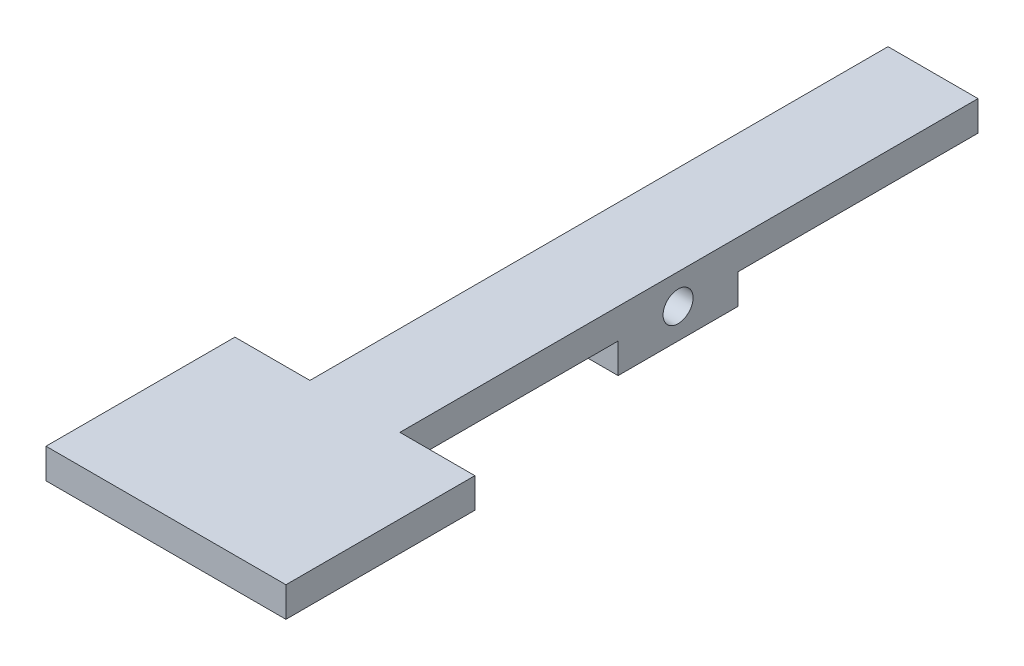
ISO-10303-21;
HEADER;
FILE_DESCRIPTION(('STEP AP214'),'2;1');
FILE_NAME('part.step','',(''),(''),'','','');
FILE_SCHEMA(('AUTOMOTIVE_DESIGN { 1 0 10303 214 1 1 1 1 }'));
ENDSEC;
DATA;
#1=APPLICATION_CONTEXT('core data for automotive mechanical design processes');
#2=APPLICATION_PROTOCOL_DEFINITION('international standard','automotive_design',2000,#1);
#3=PRODUCT_CONTEXT('',#1,'mechanical');
#4=PRODUCT('Part','Part','',(#3));
#5=PRODUCT_RELATED_PRODUCT_CATEGORY('part','',(#4));
#6=PRODUCT_DEFINITION_FORMATION('','',#4);
#7=PRODUCT_DEFINITION_CONTEXT('part definition',#1,'design');
#8=PRODUCT_DEFINITION('design','',#6,#7);
#9=PRODUCT_DEFINITION_SHAPE('','',#8);
#10=(LENGTH_UNIT() NAMED_UNIT(*) SI_UNIT(.MILLI.,.METRE.));
#11=(NAMED_UNIT(*) PLANE_ANGLE_UNIT() SI_UNIT($,.RADIAN.));
#12=(NAMED_UNIT(*) SI_UNIT($,.STERADIAN.) SOLID_ANGLE_UNIT());
#13=UNCERTAINTY_MEASURE_WITH_UNIT(LENGTH_MEASURE(1.E-05),#10,'distance_accuracy_value','');
#14=(GEOMETRIC_REPRESENTATION_CONTEXT(3) GLOBAL_UNCERTAINTY_ASSIGNED_CONTEXT((#13)) GLOBAL_UNIT_ASSIGNED_CONTEXT((#10,
#11,#12)) REPRESENTATION_CONTEXT('',''));
#15=CARTESIAN_POINT('',(0.,0.,0.));
#16=DIRECTION('',(0.,0.,1.));
#17=DIRECTION('',(1.,0.,0.));
#18=AXIS2_PLACEMENT_3D('',#15,#16,#17);
#19=CARTESIAN_POINT('',(9.525,0.,0.));
#20=DIRECTION('',(1.,0.,0.));
#21=DIRECTION('',(0.,0.,-1.));
#22=AXIS2_PLACEMENT_3D('',#19,#20,#21);
#23=PLANE('',#22);
#24=CARTESIAN_POINT('',(9.525,-1.5875,31.75));
#25=DIRECTION('',(1.,0.,0.));
#26=DIRECTION('',(0.,0.,-1.));
#27=AXIS2_PLACEMENT_3D('',#24,#25,#26);
#28=CIRCLE('',#27,1.5875);
#29=CARTESIAN_POINT('',(9.525,-1.5875,30.1625));
#30=VERTEX_POINT('',#29);
#31=EDGE_CURVE('E157',#30,#30,#28,.T.);
#32=ORIENTED_EDGE('',*,*,#31,.F.);
#33=EDGE_LOOP('',(#32));
#34=FACE_BOUND('',#33,.T.);
#35=DIRECTION('',(0.,0.,-1.));
#36=VECTOR('',#35,1.);
#37=CARTESIAN_POINT('',(9.525,1.5875,0.));
#38=LINE('',#37,#36);
#39=CARTESIAN_POINT('',(9.525,1.5875,61.2));
#40=VERTEX_POINT('',#39);
#41=CARTESIAN_POINT('',(9.525,1.5875,0.));
#42=VERTEX_POINT('',#41);
#43=EDGE_CURVE('E57',#40,#42,#38,.T.);
#44=ORIENTED_EDGE('',*,*,#43,.F.);
#45=DIRECTION('',(0.,-1.,0.));
#46=VECTOR('',#45,1.);
#47=CARTESIAN_POINT('',(9.525,0.,61.2));
#48=LINE('',#47,#46);
#49=CARTESIAN_POINT('',(9.525,-1.58750000000001,61.2));
#50=VERTEX_POINT('',#49);
#51=EDGE_CURVE('E52',#40,#50,#48,.T.);
#52=ORIENTED_EDGE('',*,*,#51,.T.);
#53=DIRECTION('',(0.,0.,1.));
#54=VECTOR('',#53,1.);
#55=CARTESIAN_POINT('',(9.525,-1.5875,0.));
#56=LINE('',#55,#54);
#57=CARTESIAN_POINT('',(9.525,-1.5875,38.1));
#58=VERTEX_POINT('',#57);
#59=EDGE_CURVE('E162',#58,#50,#56,.T.);
#60=ORIENTED_EDGE('',*,*,#59,.F.);
#61=DIRECTION('',(0.,-1.,0.));
#62=VECTOR('',#61,1.);
#63=CARTESIAN_POINT('',(9.525,0.,38.1));
#64=LINE('',#63,#62);
#65=CARTESIAN_POINT('',(9.525,-4.7625,38.1));
#66=VERTEX_POINT('',#65);
#67=EDGE_CURVE('E164',#58,#66,#64,.T.);
#68=ORIENTED_EDGE('',*,*,#67,.T.);
#69=DIRECTION('',(0.,0.,-1.));
#70=VECTOR('',#69,1.);
#71=CARTESIAN_POINT('',(9.525,-4.7625,0.));
#72=LINE('',#71,#70);
#73=CARTESIAN_POINT('',(9.525,-4.7625,25.4));
#74=VERTEX_POINT('',#73);
#75=EDGE_CURVE('E167',#66,#74,#72,.T.);
#76=ORIENTED_EDGE('',*,*,#75,.T.);
#77=DIRECTION('',(0.,-1.,0.));
#78=VECTOR('',#77,1.);
#79=CARTESIAN_POINT('',(9.525,0.,25.4));
#80=LINE('',#79,#78);
#81=CARTESIAN_POINT('',(9.525,-1.5875,25.4));
#82=VERTEX_POINT('',#81);
#83=EDGE_CURVE('E169',#82,#74,#80,.T.);
#84=ORIENTED_EDGE('',*,*,#83,.F.);
#85=DIRECTION('',(0.,0.,1.));
#86=VECTOR('',#85,1.);
#87=CARTESIAN_POINT('',(9.525,-1.5875,0.));
#88=LINE('',#87,#86);
#89=CARTESIAN_POINT('',(9.525,-1.5875,0.));
#90=VERTEX_POINT('',#89);
#91=EDGE_CURVE('E172',#90,#82,#88,.T.);
#92=ORIENTED_EDGE('',*,*,#91,.F.);
#93=DIRECTION('',(0.,-1.,0.));
#94=VECTOR('',#93,1.);
#95=CARTESIAN_POINT('',(9.525,0.,0.));
#96=LINE('',#95,#94);
#97=EDGE_CURVE('E175',#42,#90,#96,.T.);
#98=ORIENTED_EDGE('',*,*,#97,.F.);
#99=EDGE_LOOP('',(#44,#52,#60,#68,#76,#84,#92,#98));
#100=FACE_BOUND('',#99,.T.);
#101=ADVANCED_FACE('F37',(#34,#100),#23,.T.);
#102=CARTESIAN_POINT('',(0.,0.,0.));
#103=DIRECTION('',(1.,0.,0.));
#104=DIRECTION('',(0.,0.,-1.));
#105=AXIS2_PLACEMENT_3D('',#102,#103,#104);
#106=PLANE('',#105);
#107=CARTESIAN_POINT('',(0.,-1.5875,31.75));
#108=DIRECTION('',(1.,0.,0.));
#109=DIRECTION('',(0.,0.,-1.));
#110=AXIS2_PLACEMENT_3D('',#107,#108,#109);
#111=CIRCLE('',#110,1.5875);
#112=CARTESIAN_POINT('',(0.,-1.5875,30.1625));
#113=VERTEX_POINT('',#112);
#114=EDGE_CURVE('E151',#113,#113,#111,.T.);
#115=ORIENTED_EDGE('',*,*,#114,.T.);
#116=EDGE_LOOP('',(#115));
#117=FACE_BOUND('',#116,.T.);
#118=DIRECTION('',(0.,-1.,0.));
#119=VECTOR('',#118,1.);
#120=CARTESIAN_POINT('',(0.,0.,61.2));
#121=LINE('',#120,#119);
#122=CARTESIAN_POINT('',(0.,1.5875,61.2));
#123=VERTEX_POINT('',#122);
#124=CARTESIAN_POINT('',(0.,-1.5875,61.2));
#125=VERTEX_POINT('',#124);
#126=EDGE_CURVE('E11',#123,#125,#121,.T.);
#127=ORIENTED_EDGE('',*,*,#126,.F.);
#128=DIRECTION('',(0.,0.,-1.));
#129=VECTOR('',#128,1.);
#130=CARTESIAN_POINT('',(0.,1.5875,0.));
#131=LINE('',#130,#129);
#132=CARTESIAN_POINT('',(0.,1.5875,0.));
#133=VERTEX_POINT('',#132);
#134=EDGE_CURVE('E181',#123,#133,#131,.T.);
#135=ORIENTED_EDGE('',*,*,#134,.T.);
#136=DIRECTION('',(0.,-1.,0.));
#137=VECTOR('',#136,1.);
#138=CARTESIAN_POINT('',(0.,0.,0.));
#139=LINE('',#138,#137);
#140=CARTESIAN_POINT('',(0.,-1.5875,0.));
#141=VERTEX_POINT('',#140);
#142=EDGE_CURVE('E160',#133,#141,#139,.T.);
#143=ORIENTED_EDGE('',*,*,#142,.T.);
#144=DIRECTION('',(0.,0.,1.));
#145=VECTOR('',#144,1.);
#146=CARTESIAN_POINT('',(0.,-1.5875,0.));
#147=LINE('',#146,#145);
#148=CARTESIAN_POINT('',(0.,-1.5875,25.4));
#149=VERTEX_POINT('',#148);
#150=EDGE_CURVE('E194',#141,#149,#147,.T.);
#151=ORIENTED_EDGE('',*,*,#150,.T.);
#152=DIRECTION('',(0.,-1.,0.));
#153=VECTOR('',#152,1.);
#154=CARTESIAN_POINT('',(0.,0.,25.4));
#155=LINE('',#154,#153);
#156=CARTESIAN_POINT('',(0.,-4.7625,25.4));
#157=VERTEX_POINT('',#156);
#158=EDGE_CURVE('E191',#149,#157,#155,.T.);
#159=ORIENTED_EDGE('',*,*,#158,.T.);
#160=DIRECTION('',(0.,0.,-1.));
#161=VECTOR('',#160,1.);
#162=CARTESIAN_POINT('',(0.,-4.7625,0.));
#163=LINE('',#162,#161);
#164=CARTESIAN_POINT('',(0.,-4.7625,38.1));
#165=VERTEX_POINT('',#164);
#166=EDGE_CURVE('E188',#165,#157,#163,.T.);
#167=ORIENTED_EDGE('',*,*,#166,.F.);
#168=DIRECTION('',(0.,-1.,0.));
#169=VECTOR('',#168,1.);
#170=CARTESIAN_POINT('',(0.,0.,38.1));
#171=LINE('',#170,#169);
#172=CARTESIAN_POINT('',(0.,-1.5875,38.1));
#173=VERTEX_POINT('',#172);
#174=EDGE_CURVE('E185',#173,#165,#171,.T.);
#175=ORIENTED_EDGE('',*,*,#174,.F.);
#176=DIRECTION('',(0.,0.,1.));
#177=VECTOR('',#176,1.);
#178=CARTESIAN_POINT('',(0.,-1.5875,0.));
#179=LINE('',#178,#177);
#180=EDGE_CURVE('E183',#173,#125,#179,.T.);
#181=ORIENTED_EDGE('',*,*,#180,.T.);
#182=EDGE_LOOP('',(#127,#135,#143,#151,#159,#167,#175,#181));
#183=FACE_BOUND('',#182,.T.);
#184=ADVANCED_FACE('F217',(#117,#183),#106,.F.);
#185=CARTESIAN_POINT('',(9.525,1.5875,0.));
#186=DIRECTION('',(0.,1.,0.));
#187=DIRECTION('',(0.,0.,1.));
#188=AXIS2_PLACEMENT_3D('',#185,#186,#187);
#189=PLANE('',#188);
#190=DIRECTION('',(-1.,0.,0.));
#191=VECTOR('',#190,1.);
#192=CARTESIAN_POINT('',(17.4625,1.5875,61.2));
#193=LINE('',#192,#191);
#194=CARTESIAN_POINT('',(17.4625,1.5875,61.2));
#195=VERTEX_POINT('',#194);
#196=EDGE_CURVE('E227',#195,#40,#193,.T.);
#197=ORIENTED_EDGE('',*,*,#196,.T.);
#198=ORIENTED_EDGE('',*,*,#43,.T.);
#199=DIRECTION('',(-1.,0.,0.));
#200=VECTOR('',#199,1.);
#201=CARTESIAN_POINT('',(9.525,1.5875,0.));
#202=LINE('',#201,#200);
#203=EDGE_CURVE('E178',#42,#133,#202,.T.);
#204=ORIENTED_EDGE('',*,*,#203,.T.);
#205=ORIENTED_EDGE('',*,*,#134,.F.);
#206=CARTESIAN_POINT('',(-7.9375,1.5875,61.2));
#207=VERTEX_POINT('',#206);
#208=EDGE_CURVE('E229',#123,#207,#193,.T.);
#209=ORIENTED_EDGE('',*,*,#208,.T.);
#210=DIRECTION('',(0.,0.,1.));
#211=VECTOR('',#210,1.);
#212=CARTESIAN_POINT('',(-7.9375,1.58750000000001,0.));
#213=LINE('',#212,#211);
#214=CARTESIAN_POINT('',(-7.9375,1.5875,81.2));
#215=VERTEX_POINT('',#214);
#216=EDGE_CURVE('E149',#207,#215,#213,.T.);
#217=ORIENTED_EDGE('',*,*,#216,.T.);
#218=DIRECTION('',(-1.,0.,0.));
#219=VECTOR('',#218,1.);
#220=CARTESIAN_POINT('',(17.4625,1.5875,81.2));
#221=LINE('',#220,#219);
#222=CARTESIAN_POINT('',(17.4625,1.5875,81.2));
#223=VERTEX_POINT('',#222);
#224=EDGE_CURVE('E129',#223,#215,#221,.T.);
#225=ORIENTED_EDGE('',*,*,#224,.F.);
#226=DIRECTION('',(0.,0.,1.));
#227=VECTOR('',#226,1.);
#228=CARTESIAN_POINT('',(17.4625,1.58750000000001,0.));
#229=LINE('',#228,#227);
#230=EDGE_CURVE('E136',#195,#223,#229,.T.);
#231=ORIENTED_EDGE('',*,*,#230,.F.);
#232=EDGE_LOOP('',(#197,#198,#204,#205,#209,#217,#225,#231));
#233=FACE_BOUND('',#232,.T.);
#234=ADVANCED_FACE('F147',(#233),#189,.T.);
#235=CARTESIAN_POINT('',(9.525,-1.5875,0.));
#236=DIRECTION('',(0.,-1.,0.));
#237=DIRECTION('',(0.,0.,-1.));
#238=AXIS2_PLACEMENT_3D('',#235,#236,#237);
#239=PLANE('',#238);
#240=DIRECTION('',(-1.,0.,0.));
#241=VECTOR('',#240,1.);
#242=CARTESIAN_POINT('',(17.4625,-1.5875,61.2));
#243=LINE('',#242,#241);
#244=CARTESIAN_POINT('',(-7.9375,-1.5875,61.2));
#245=VERTEX_POINT('',#244);
#246=EDGE_CURVE('E221',#125,#245,#243,.T.);
#247=ORIENTED_EDGE('',*,*,#246,.F.);
#248=ORIENTED_EDGE('',*,*,#180,.F.);
#249=DIRECTION('',(-1.,0.,0.));
#250=VECTOR('',#249,1.);
#251=CARTESIAN_POINT('',(9.525,-1.5875,38.1));
#252=LINE('',#251,#250);
#253=EDGE_CURVE('E45',#58,#173,#252,.T.);
#254=ORIENTED_EDGE('',*,*,#253,.F.);
#255=ORIENTED_EDGE('',*,*,#59,.T.);
#256=CARTESIAN_POINT('',(17.4625,-1.5875,61.2));
#257=VERTEX_POINT('',#256);
#258=EDGE_CURVE('E153',#257,#50,#243,.T.);
#259=ORIENTED_EDGE('',*,*,#258,.F.);
#260=DIRECTION('',(0.,0.,-1.));
#261=VECTOR('',#260,1.);
#262=CARTESIAN_POINT('',(17.4625,-1.5875,0.));
#263=LINE('',#262,#261);
#264=CARTESIAN_POINT('',(17.4625,-1.58750000000001,81.2));
#265=VERTEX_POINT('',#264);
#266=EDGE_CURVE('E135',#265,#257,#263,.T.);
#267=ORIENTED_EDGE('',*,*,#266,.F.);
#268=DIRECTION('',(-1.,0.,0.));
#269=VECTOR('',#268,1.);
#270=CARTESIAN_POINT('',(17.4625,-1.58750000000001,81.2));
#271=LINE('',#270,#269);
#272=CARTESIAN_POINT('',(-7.9375,-1.58750000000001,81.2));
#273=VERTEX_POINT('',#272);
#274=EDGE_CURVE('E132',#265,#273,#271,.T.);
#275=ORIENTED_EDGE('',*,*,#274,.T.);
#276=DIRECTION('',(0.,0.,-1.));
#277=VECTOR('',#276,1.);
#278=CARTESIAN_POINT('',(-7.9375,-1.5875,0.));
#279=LINE('',#278,#277);
#280=EDGE_CURVE('E223',#273,#245,#279,.T.);
#281=ORIENTED_EDGE('',*,*,#280,.T.);
#282=EDGE_LOOP('',(#247,#248,#254,#255,#259,#267,#275,#281));
#283=FACE_BOUND('',#282,.T.);
#284=ADVANCED_FACE('F219',(#283),#239,.T.);
#285=CARTESIAN_POINT('',(9.525,0.,38.1));
#286=DIRECTION('',(0.,0.,-1.));
#287=DIRECTION('',(-1.,0.,0.));
#288=AXIS2_PLACEMENT_3D('',#285,#286,#287);
#289=PLANE('',#288);
#290=ORIENTED_EDGE('',*,*,#174,.T.);
#291=DIRECTION('',(-1.,0.,0.));
#292=VECTOR('',#291,1.);
#293=CARTESIAN_POINT('',(9.525,-4.7625,38.1));
#294=LINE('',#293,#292);
#295=EDGE_CURVE('E207',#66,#165,#294,.T.);
#296=ORIENTED_EDGE('',*,*,#295,.F.);
#297=ORIENTED_EDGE('',*,*,#67,.F.);
#298=ORIENTED_EDGE('',*,*,#253,.T.);
#299=EDGE_LOOP('',(#290,#296,#297,#298));
#300=FACE_BOUND('',#299,.T.);
#301=ADVANCED_FACE('F212',(#300),#289,.F.);
#302=CARTESIAN_POINT('',(9.525,-4.7625,0.));
#303=DIRECTION('',(0.,1.,0.));
#304=DIRECTION('',(0.,0.,1.));
#305=AXIS2_PLACEMENT_3D('',#302,#303,#304);
#306=PLANE('',#305);
#307=ORIENTED_EDGE('',*,*,#166,.T.);
#308=DIRECTION('',(-1.,0.,0.));
#309=VECTOR('',#308,1.);
#310=CARTESIAN_POINT('',(9.525,-4.7625,25.4));
#311=LINE('',#310,#309);
#312=EDGE_CURVE('E205',#74,#157,#311,.T.);
#313=ORIENTED_EDGE('',*,*,#312,.F.);
#314=ORIENTED_EDGE('',*,*,#75,.F.);
#315=ORIENTED_EDGE('',*,*,#295,.T.);
#316=EDGE_LOOP('',(#307,#313,#314,#315));
#317=FACE_BOUND('',#316,.T.);
#318=ADVANCED_FACE('F281',(#317),#306,.F.);
#319=CARTESIAN_POINT('',(9.525,0.,25.4));
#320=DIRECTION('',(0.,0.,-1.));
#321=DIRECTION('',(-1.,0.,0.));
#322=AXIS2_PLACEMENT_3D('',#319,#320,#321);
#323=PLANE('',#322);
#324=ORIENTED_EDGE('',*,*,#158,.F.);
#325=DIRECTION('',(-1.,0.,0.));
#326=VECTOR('',#325,1.);
#327=CARTESIAN_POINT('',(9.525,-1.5875,25.4));
#328=LINE('',#327,#326);
#329=EDGE_CURVE('E203',#82,#149,#328,.T.);
#330=ORIENTED_EDGE('',*,*,#329,.F.);
#331=ORIENTED_EDGE('',*,*,#83,.T.);
#332=ORIENTED_EDGE('',*,*,#312,.T.);
#333=EDGE_LOOP('',(#324,#330,#331,#332));
#334=FACE_BOUND('',#333,.T.);
#335=ADVANCED_FACE('F278',(#334),#323,.T.);
#336=CARTESIAN_POINT('',(9.525,-1.5875,0.));
#337=DIRECTION('',(0.,-1.,0.));
#338=DIRECTION('',(0.,0.,-1.));
#339=AXIS2_PLACEMENT_3D('',#336,#337,#338);
#340=PLANE('',#339);
#341=ORIENTED_EDGE('',*,*,#150,.F.);
#342=DIRECTION('',(-1.,0.,0.));
#343=VECTOR('',#342,1.);
#344=CARTESIAN_POINT('',(9.525,-1.5875,0.));
#345=LINE('',#344,#343);
#346=EDGE_CURVE('E201',#90,#141,#345,.T.);
#347=ORIENTED_EDGE('',*,*,#346,.F.);
#348=ORIENTED_EDGE('',*,*,#91,.T.);
#349=ORIENTED_EDGE('',*,*,#329,.T.);
#350=EDGE_LOOP('',(#341,#347,#348,#349));
#351=FACE_BOUND('',#350,.T.);
#352=ADVANCED_FACE('F250',(#351),#340,.T.);
#353=CARTESIAN_POINT('',(9.525,-1.5875,31.75));
#354=DIRECTION('',(-1.,0.,0.));
#355=DIRECTION('',(0.,0.,1.));
#356=AXIS2_PLACEMENT_3D('',#353,#354,#355);
#357=CYLINDRICAL_SURFACE('',#356,1.5875);
#358=ORIENTED_EDGE('',*,*,#31,.T.);
#359=EDGE_LOOP('',(#358));
#360=FACE_BOUND('',#359,.T.);
#361=ORIENTED_EDGE('',*,*,#114,.F.);
#362=EDGE_LOOP('',(#361));
#363=FACE_BOUND('',#362,.T.);
#364=ADVANCED_FACE('F39',(#360,#363),#357,.F.);
#365=CARTESIAN_POINT('',(9.525,0.,0.));
#366=DIRECTION('',(0.,0.,-1.));
#367=DIRECTION('',(0.,1.,0.));
#368=AXIS2_PLACEMENT_3D('',#365,#366,#367);
#369=PLANE('',#368);
#370=ORIENTED_EDGE('',*,*,#142,.F.);
#371=ORIENTED_EDGE('',*,*,#203,.F.);
#372=ORIENTED_EDGE('',*,*,#97,.T.);
#373=ORIENTED_EDGE('',*,*,#346,.T.);
#374=EDGE_LOOP('',(#370,#371,#372,#373));
#375=FACE_BOUND('',#374,.T.);
#376=ADVANCED_FACE('F245',(#375),#369,.T.);
#377=CARTESIAN_POINT('',(17.4625,0.,61.2));
#378=DIRECTION('',(0.,0.,1.));
#379=DIRECTION('',(1.,0.,0.));
#380=AXIS2_PLACEMENT_3D('',#377,#378,#379);
#381=PLANE('',#380);
#382=ORIENTED_EDGE('',*,*,#208,.F.);
#383=ORIENTED_EDGE('',*,*,#126,.T.);
#384=ORIENTED_EDGE('',*,*,#246,.T.);
#385=DIRECTION('',(0.,1.,0.));
#386=VECTOR('',#385,1.);
#387=CARTESIAN_POINT('',(-7.9375,0.,61.2));
#388=LINE('',#387,#386);
#389=EDGE_CURVE('E145',#245,#207,#388,.T.);
#390=ORIENTED_EDGE('',*,*,#389,.T.);
#391=EDGE_LOOP('',(#382,#383,#384,#390));
#392=FACE_BOUND('',#391,.T.);
#393=ADVANCED_FACE('F253',(#392),#381,.F.);
#394=CARTESIAN_POINT('',(17.4625,0.,81.2));
#395=DIRECTION('',(0.,0.,-1.));
#396=DIRECTION('',(-1.,0.,0.));
#397=AXIS2_PLACEMENT_3D('',#394,#395,#396);
#398=PLANE('',#397);
#399=DIRECTION('',(0.,-1.,0.));
#400=VECTOR('',#399,1.);
#401=CARTESIAN_POINT('',(-7.9375,0.,81.2));
#402=LINE('',#401,#400);
#403=EDGE_CURVE('E234',#215,#273,#402,.T.);
#404=ORIENTED_EDGE('',*,*,#403,.T.);
#405=ORIENTED_EDGE('',*,*,#274,.F.);
#406=DIRECTION('',(0.,-1.,0.));
#407=VECTOR('',#406,1.);
#408=CARTESIAN_POINT('',(17.4625,0.,81.2));
#409=LINE('',#408,#407);
#410=EDGE_CURVE('E125',#223,#265,#409,.T.);
#411=ORIENTED_EDGE('',*,*,#410,.F.);
#412=ORIENTED_EDGE('',*,*,#224,.T.);
#413=EDGE_LOOP('',(#404,#405,#411,#412));
#414=FACE_BOUND('',#413,.T.);
#415=ADVANCED_FACE('F127',(#414),#398,.F.);
#416=ORIENTED_EDGE('',*,*,#51,.F.);
#417=ORIENTED_EDGE('',*,*,#196,.F.);
#418=DIRECTION('',(0.,1.,0.));
#419=VECTOR('',#418,1.);
#420=CARTESIAN_POINT('',(17.4625,0.,61.2));
#421=LINE('',#420,#419);
#422=EDGE_CURVE('E141',#257,#195,#421,.T.);
#423=ORIENTED_EDGE('',*,*,#422,.F.);
#424=ORIENTED_EDGE('',*,*,#258,.T.);
#425=EDGE_LOOP('',(#416,#417,#423,#424));
#426=FACE_BOUND('',#425,.T.);
#427=ADVANCED_FACE('F240',(#426),#381,.F.);
#428=CARTESIAN_POINT('',(17.4625,0.,0.));
#429=DIRECTION('',(1.,0.,0.));
#430=DIRECTION('',(0.,0.,-1.));
#431=AXIS2_PLACEMENT_3D('',#428,#429,#430);
#432=PLANE('',#431);
#433=ORIENTED_EDGE('',*,*,#230,.T.);
#434=ORIENTED_EDGE('',*,*,#410,.T.);
#435=ORIENTED_EDGE('',*,*,#266,.T.);
#436=ORIENTED_EDGE('',*,*,#422,.T.);
#437=EDGE_LOOP('',(#433,#434,#435,#436));
#438=FACE_BOUND('',#437,.T.);
#439=ADVANCED_FACE('F139',(#438),#432,.T.);
#440=CARTESIAN_POINT('',(-7.9375,0.,0.));
#441=DIRECTION('',(1.,0.,0.));
#442=DIRECTION('',(0.,0.,-1.));
#443=AXIS2_PLACEMENT_3D('',#440,#441,#442);
#444=PLANE('',#443);
#445=ORIENTED_EDGE('',*,*,#216,.F.);
#446=ORIENTED_EDGE('',*,*,#389,.F.);
#447=ORIENTED_EDGE('',*,*,#280,.F.);
#448=ORIENTED_EDGE('',*,*,#403,.F.);
#449=EDGE_LOOP('',(#445,#446,#447,#448));
#450=FACE_BOUND('',#449,.T.);
#451=ADVANCED_FACE('F255',(#450),#444,.F.);
#452=CLOSED_SHELL('',(#101,#184,#234,#284,#301,#318,#335,#352,#364,#376,#393,#415,#427,#439,#451));
#453=MANIFOLD_SOLID_BREP('B2',#452);
#454=ADVANCED_BREP_SHAPE_REPRESENTATION('',(#18,#453),#14);
#455=SHAPE_DEFINITION_REPRESENTATION(#9,#454);
ENDSEC;
END-ISO-10303-21;
